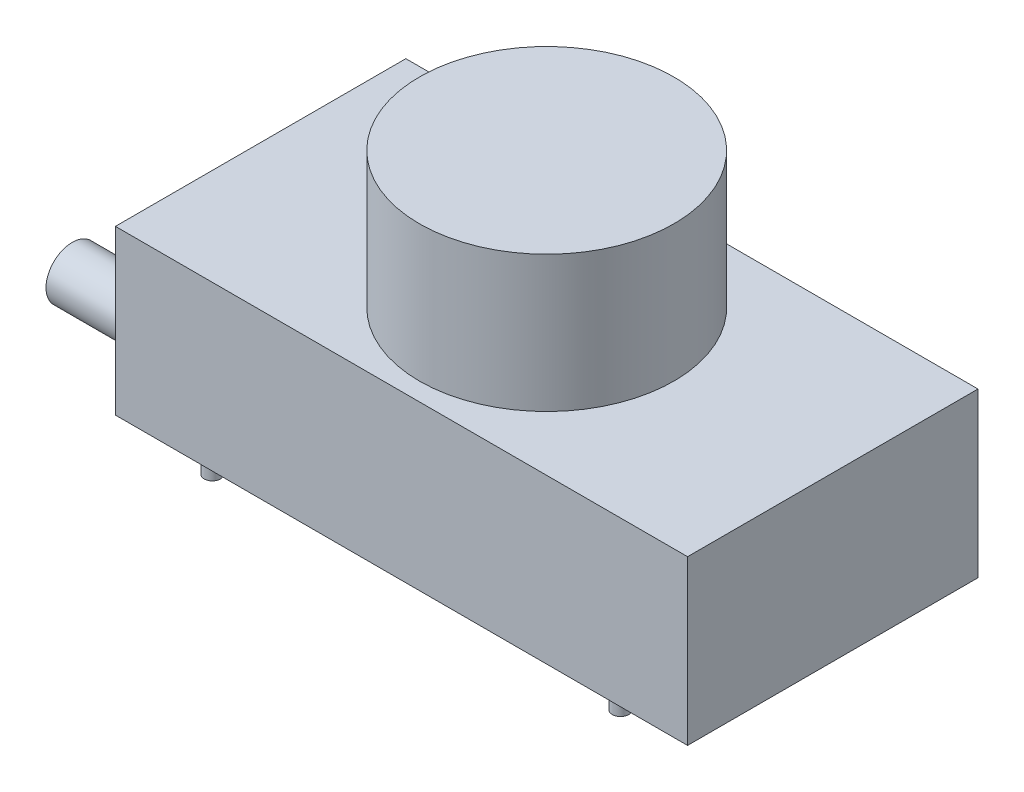
ISO-10303-21;
HEADER;
FILE_DESCRIPTION(('STEP AP214'),'2;1');
FILE_NAME('part.step','',(''),(''),'','','');
FILE_SCHEMA(('AUTOMOTIVE_DESIGN { 1 0 10303 214 1 1 1 1 }'));
ENDSEC;
DATA;
#1=APPLICATION_CONTEXT('core data for automotive mechanical design processes');
#2=APPLICATION_PROTOCOL_DEFINITION('international standard','automotive_design',2000,#1);
#3=PRODUCT_CONTEXT('',#1,'mechanical');
#4=PRODUCT('Part','Part','',(#3));
#5=PRODUCT_RELATED_PRODUCT_CATEGORY('part','',(#4));
#6=PRODUCT_DEFINITION_FORMATION('','',#4);
#7=PRODUCT_DEFINITION_CONTEXT('part definition',#1,'design');
#8=PRODUCT_DEFINITION('design','',#6,#7);
#9=PRODUCT_DEFINITION_SHAPE('','',#8);
#10=(LENGTH_UNIT() NAMED_UNIT(*) SI_UNIT(.MILLI.,.METRE.));
#11=(NAMED_UNIT(*) PLANE_ANGLE_UNIT() SI_UNIT($,.RADIAN.));
#12=(NAMED_UNIT(*) SI_UNIT($,.STERADIAN.) SOLID_ANGLE_UNIT());
#13=UNCERTAINTY_MEASURE_WITH_UNIT(LENGTH_MEASURE(1.E-05),#10,'distance_accuracy_value','');
#14=(GEOMETRIC_REPRESENTATION_CONTEXT(3) GLOBAL_UNCERTAINTY_ASSIGNED_CONTEXT((#13)) GLOBAL_UNIT_ASSIGNED_CONTEXT((#10,
#11,#12)) REPRESENTATION_CONTEXT('',''));
#15=CARTESIAN_POINT('',(0.,0.,0.));
#16=DIRECTION('',(0.,0.,1.));
#17=DIRECTION('',(1.,0.,0.));
#18=AXIS2_PLACEMENT_3D('',#15,#16,#17);
#19=CARTESIAN_POINT('',(-52.5,30.,26.65));
#20=DIRECTION('',(1.,0.,0.));
#21=DIRECTION('',(0.,0.,-1.));
#22=AXIS2_PLACEMENT_3D('',#19,#20,#21);
#23=PLANE('',#22);
#24=CARTESIAN_POINT('',(-52.5,6.60271093703635,14.5675092797255));
#25=DIRECTION('',(1.,0.,0.));
#26=DIRECTION('',(0.,0.,-1.));
#27=AXIS2_PLACEMENT_3D('',#24,#25,#26);
#28=CIRCLE('',#27,4.81872066748661);
#29=CARTESIAN_POINT('',(-52.5,6.60271093703635,9.74878861223889));
#30=VERTEX_POINT('',#29);
#31=EDGE_CURVE('E43',#30,#30,#28,.F.);
#32=ORIENTED_EDGE('',*,*,#31,.F.);
#33=EDGE_LOOP('',(#32));
#34=FACE_BOUND('',#33,.T.);
#35=DIRECTION('',(0.,0.,1.));
#36=VECTOR('',#35,1.);
#37=CARTESIAN_POINT('',(-52.5,0.,26.65));
#38=LINE('',#37,#36);
#39=CARTESIAN_POINT('',(-52.5,0.,-26.65));
#40=VERTEX_POINT('',#39);
#41=CARTESIAN_POINT('',(-52.5,0.,26.65));
#42=VERTEX_POINT('',#41);
#43=EDGE_CURVE('E158',#40,#42,#38,.T.);
#44=ORIENTED_EDGE('',*,*,#43,.T.);
#45=DIRECTION('',(0.,-1.,0.));
#46=VECTOR('',#45,1.);
#47=CARTESIAN_POINT('',(-52.5,30.,26.65));
#48=LINE('',#47,#46);
#49=CARTESIAN_POINT('',(-52.5,30.,26.65));
#50=VERTEX_POINT('',#49);
#51=EDGE_CURVE('E166',#50,#42,#48,.T.);
#52=ORIENTED_EDGE('',*,*,#51,.F.);
#53=DIRECTION('',(0.,0.,1.));
#54=VECTOR('',#53,1.);
#55=CARTESIAN_POINT('',(-52.5,30.,26.65));
#56=LINE('',#55,#54);
#57=CARTESIAN_POINT('',(-52.5,30.,-26.65));
#58=VERTEX_POINT('',#57);
#59=EDGE_CURVE('E149',#58,#50,#56,.T.);
#60=ORIENTED_EDGE('',*,*,#59,.F.);
#61=DIRECTION('',(0.,-1.,0.));
#62=VECTOR('',#61,1.);
#63=CARTESIAN_POINT('',(-52.5,30.,-26.65));
#64=LINE('',#63,#62);
#65=EDGE_CURVE('E170',#58,#40,#64,.T.);
#66=ORIENTED_EDGE('',*,*,#65,.T.);
#67=EDGE_LOOP('',(#44,#52,#60,#66));
#68=FACE_BOUND('',#67,.T.);
#69=DIRECTION('',(0.,1.,0.));
#70=VECTOR('',#69,1.);
#71=CARTESIAN_POINT('',(-52.5,1.57083362304267,-14.011997553169));
#72=LINE('',#71,#70);
#73=CARTESIAN_POINT('',(-52.5,1.57083362304267,-14.011997553169));
#74=VERTEX_POINT('',#73);
#75=CARTESIAN_POINT('',(-52.5,8.82388546653612,-14.011997553169));
#76=VERTEX_POINT('',#75);
#77=EDGE_CURVE('E128',#74,#76,#72,.T.);
#78=ORIENTED_EDGE('',*,*,#77,.F.);
#79=DIRECTION('',(0.,0.,1.));
#80=VECTOR('',#79,1.);
#81=CARTESIAN_POINT('',(-52.5,1.57083362304267,-21.6019036167339));
#82=LINE('',#81,#80);
#83=CARTESIAN_POINT('',(-52.5,1.57083362304267,-21.6019036167339));
#84=VERTEX_POINT('',#83);
#85=EDGE_CURVE('E125',#84,#74,#82,.T.);
#86=ORIENTED_EDGE('',*,*,#85,.F.);
#87=DIRECTION('',(0.,-1.,0.));
#88=VECTOR('',#87,1.);
#89=CARTESIAN_POINT('',(-52.5,1.57083362304267,-21.6019036167339));
#90=LINE('',#89,#88);
#91=CARTESIAN_POINT('',(-52.5,8.82388546653612,-21.6019036167339));
#92=VERTEX_POINT('',#91);
#93=EDGE_CURVE('E61',#92,#84,#90,.T.);
#94=ORIENTED_EDGE('',*,*,#93,.F.);
#95=DIRECTION('',(0.,0.,-1.));
#96=VECTOR('',#95,1.);
#97=CARTESIAN_POINT('',(-52.5,8.82388546653612,-21.6019036167339));
#98=LINE('',#97,#96);
#99=EDGE_CURVE('E56',#76,#92,#98,.T.);
#100=ORIENTED_EDGE('',*,*,#99,.F.);
#101=EDGE_LOOP('',(#78,#86,#94,#100));
#102=FACE_BOUND('',#101,.T.);
#103=ADVANCED_FACE('F39',(#34,#68,#102),#23,.F.);
#104=CARTESIAN_POINT('',(52.5,30.,26.65));
#105=DIRECTION('',(-1.,0.,0.));
#106=DIRECTION('',(0.,0.,1.));
#107=AXIS2_PLACEMENT_3D('',#104,#105,#106);
#108=PLANE('',#107);
#109=DIRECTION('',(0.,0.,-1.));
#110=VECTOR('',#109,1.);
#111=CARTESIAN_POINT('',(52.5,0.,26.65));
#112=LINE('',#111,#110);
#113=CARTESIAN_POINT('',(52.5,0.,26.65));
#114=VERTEX_POINT('',#113);
#115=CARTESIAN_POINT('',(52.5,0.,-26.65));
#116=VERTEX_POINT('',#115);
#117=EDGE_CURVE('E130',#114,#116,#112,.T.);
#118=ORIENTED_EDGE('',*,*,#117,.T.);
#119=DIRECTION('',(0.,-1.,0.));
#120=VECTOR('',#119,1.);
#121=CARTESIAN_POINT('',(52.5,30.,-26.65));
#122=LINE('',#121,#120);
#123=CARTESIAN_POINT('',(52.5,30.,-26.65));
#124=VERTEX_POINT('',#123);
#125=EDGE_CURVE('E173',#124,#116,#122,.T.);
#126=ORIENTED_EDGE('',*,*,#125,.F.);
#127=DIRECTION('',(0.,0.,-1.));
#128=VECTOR('',#127,1.);
#129=CARTESIAN_POINT('',(52.5,30.,26.65));
#130=LINE('',#129,#128);
#131=CARTESIAN_POINT('',(52.5,30.,26.65));
#132=VERTEX_POINT('',#131);
#133=EDGE_CURVE('E141',#132,#124,#130,.T.);
#134=ORIENTED_EDGE('',*,*,#133,.F.);
#135=DIRECTION('',(0.,-1.,0.));
#136=VECTOR('',#135,1.);
#137=CARTESIAN_POINT('',(52.5,30.,26.65));
#138=LINE('',#137,#136);
#139=EDGE_CURVE('E154',#132,#114,#138,.T.);
#140=ORIENTED_EDGE('',*,*,#139,.T.);
#141=EDGE_LOOP('',(#118,#126,#134,#140));
#142=FACE_BOUND('',#141,.T.);
#143=ADVANCED_FACE('F41',(#142),#108,.F.);
#144=CARTESIAN_POINT('',(-52.5,30.,-26.65));
#145=DIRECTION('',(0.,0.,1.));
#146=DIRECTION('',(1.,0.,0.));
#147=AXIS2_PLACEMENT_3D('',#144,#145,#146);
#148=PLANE('',#147);
#149=DIRECTION('',(-1.,0.,0.));
#150=VECTOR('',#149,1.);
#151=CARTESIAN_POINT('',(-52.5,0.,-26.65));
#152=LINE('',#151,#150);
#153=EDGE_CURVE('E135',#116,#40,#152,.T.);
#154=ORIENTED_EDGE('',*,*,#153,.T.);
#155=ORIENTED_EDGE('',*,*,#65,.F.);
#156=DIRECTION('',(-1.,0.,0.));
#157=VECTOR('',#156,1.);
#158=CARTESIAN_POINT('',(-52.5,30.,-26.65));
#159=LINE('',#158,#157);
#160=EDGE_CURVE('E145',#124,#58,#159,.T.);
#161=ORIENTED_EDGE('',*,*,#160,.F.);
#162=ORIENTED_EDGE('',*,*,#125,.T.);
#163=EDGE_LOOP('',(#154,#155,#161,#162));
#164=FACE_BOUND('',#163,.T.);
#165=ADVANCED_FACE('F283',(#164),#148,.F.);
#166=CARTESIAN_POINT('',(-52.5,30.,26.65));
#167=DIRECTION('',(0.,0.,-1.));
#168=DIRECTION('',(-1.,0.,0.));
#169=AXIS2_PLACEMENT_3D('',#166,#167,#168);
#170=PLANE('',#169);
#171=DIRECTION('',(1.,0.,0.));
#172=VECTOR('',#171,1.);
#173=CARTESIAN_POINT('',(-52.5,0.,26.65));
#174=LINE('',#173,#172);
#175=EDGE_CURVE('E146',#42,#114,#174,.T.);
#176=ORIENTED_EDGE('',*,*,#175,.T.);
#177=ORIENTED_EDGE('',*,*,#139,.F.);
#178=DIRECTION('',(1.,0.,0.));
#179=VECTOR('',#178,1.);
#180=CARTESIAN_POINT('',(-52.5,30.,26.65));
#181=LINE('',#180,#179);
#182=EDGE_CURVE('E152',#50,#132,#181,.T.);
#183=ORIENTED_EDGE('',*,*,#182,.F.);
#184=ORIENTED_EDGE('',*,*,#51,.T.);
#185=EDGE_LOOP('',(#176,#177,#183,#184));
#186=FACE_BOUND('',#185,.T.);
#187=ADVANCED_FACE('F279',(#186),#170,.F.);
#188=CARTESIAN_POINT('',(0.,30.,0.));
#189=DIRECTION('',(0.,-1.,0.));
#190=DIRECTION('',(0.,0.,-1.));
#191=AXIS2_PLACEMENT_3D('',#188,#189,#190);
#192=PLANE('',#191);
#193=CARTESIAN_POINT('',(0.,30.,0.));
#194=DIRECTION('',(0.,1.,0.));
#195=DIRECTION('',(0.,0.,1.));
#196=AXIS2_PLACEMENT_3D('',#193,#194,#195);
#197=CIRCLE('',#196,23.3494689800035);
#198=CARTESIAN_POINT('',(0.,30.,23.3494689800035));
#199=VERTEX_POINT('',#198);
#200=EDGE_CURVE('E11',#199,#199,#197,.T.);
#201=ORIENTED_EDGE('',*,*,#200,.F.);
#202=EDGE_LOOP('',(#201));
#203=FACE_BOUND('',#202,.T.);
#204=ORIENTED_EDGE('',*,*,#133,.T.);
#205=ORIENTED_EDGE('',*,*,#160,.T.);
#206=ORIENTED_EDGE('',*,*,#59,.T.);
#207=ORIENTED_EDGE('',*,*,#182,.T.);
#208=EDGE_LOOP('',(#204,#205,#206,#207));
#209=FACE_BOUND('',#208,.T.);
#210=ADVANCED_FACE('F264',(#203,#209),#192,.F.);
#211=CARTESIAN_POINT('',(0.,0.,0.));
#212=DIRECTION('',(0.,-1.,0.));
#213=DIRECTION('',(0.,0.,-1.));
#214=AXIS2_PLACEMENT_3D('',#211,#212,#213);
#215=PLANE('',#214);
#216=CARTESIAN_POINT('',(43.6,0.,-24.15));
#217=DIRECTION('',(0.,-1.,0.));
#218=DIRECTION('',(0.,0.,-1.));
#219=AXIS2_PLACEMENT_3D('',#216,#217,#218);
#220=CIRCLE('',#219,1.5);
#221=CARTESIAN_POINT('',(43.6,0.,-25.65));
#222=VERTEX_POINT('',#221);
#223=EDGE_CURVE('E244',#222,#222,#220,.T.);
#224=ORIENTED_EDGE('',*,*,#223,.F.);
#225=EDGE_LOOP('',(#224));
#226=FACE_BOUND('',#225,.T.);
#227=CARTESIAN_POINT('',(37.7,0.,24.15));
#228=DIRECTION('',(0.,-1.,0.));
#229=DIRECTION('',(0.,0.,-1.));
#230=AXIS2_PLACEMENT_3D('',#227,#228,#229);
#231=CIRCLE('',#230,1.5);
#232=CARTESIAN_POINT('',(37.7,0.,22.65));
#233=VERTEX_POINT('',#232);
#234=EDGE_CURVE('E236',#233,#233,#231,.T.);
#235=ORIENTED_EDGE('',*,*,#234,.F.);
#236=EDGE_LOOP('',(#235));
#237=FACE_BOUND('',#236,.T.);
#238=CARTESIAN_POINT('',(-38.5,0.,-24.15));
#239=DIRECTION('',(0.,-1.,0.));
#240=DIRECTION('',(0.,0.,-1.));
#241=AXIS2_PLACEMENT_3D('',#238,#239,#240);
#242=CIRCLE('',#241,1.5);
#243=CARTESIAN_POINT('',(-38.5,0.,-25.65));
#244=VERTEX_POINT('',#243);
#245=EDGE_CURVE('E228',#244,#244,#242,.T.);
#246=ORIENTED_EDGE('',*,*,#245,.F.);
#247=EDGE_LOOP('',(#246));
#248=FACE_BOUND('',#247,.T.);
#249=CARTESIAN_POINT('',(-37.2,0.,24.15));
#250=DIRECTION('',(0.,-1.,0.));
#251=DIRECTION('',(0.,0.,-1.));
#252=AXIS2_PLACEMENT_3D('',#249,#250,#251);
#253=CIRCLE('',#252,1.5);
#254=CARTESIAN_POINT('',(-37.2,0.,22.65));
#255=VERTEX_POINT('',#254);
#256=EDGE_CURVE('E220',#255,#255,#253,.T.);
#257=ORIENTED_EDGE('',*,*,#256,.F.);
#258=EDGE_LOOP('',(#257));
#259=FACE_BOUND('',#258,.T.);
#260=ORIENTED_EDGE('',*,*,#117,.F.);
#261=ORIENTED_EDGE('',*,*,#175,.F.);
#262=ORIENTED_EDGE('',*,*,#43,.F.);
#263=ORIENTED_EDGE('',*,*,#153,.F.);
#264=EDGE_LOOP('',(#260,#261,#262,#263));
#265=FACE_BOUND('',#264,.T.);
#266=ADVANCED_FACE('F261',(#226,#237,#248,#259,#265),#215,.T.);
#267=CARTESIAN_POINT('',(-72.5,1.57083362304267,-14.011997553169));
#268=DIRECTION('',(0.,0.,-1.));
#269=DIRECTION('',(-1.,0.,0.));
#270=AXIS2_PLACEMENT_3D('',#267,#268,#269);
#271=PLANE('',#270);
#272=ORIENTED_EDGE('',*,*,#77,.T.);
#273=DIRECTION('',(1.,0.,0.));
#274=VECTOR('',#273,1.);
#275=CARTESIAN_POINT('',(-72.5,8.82388546653612,-14.011997553169));
#276=LINE('',#275,#274);
#277=CARTESIAN_POINT('',(-72.5,8.82388546653612,-14.011997553169));
#278=VERTEX_POINT('',#277);
#279=EDGE_CURVE('E107',#278,#76,#276,.T.);
#280=ORIENTED_EDGE('',*,*,#279,.F.);
#281=DIRECTION('',(0.,1.,0.));
#282=VECTOR('',#281,1.);
#283=CARTESIAN_POINT('',(-72.5,1.57083362304267,-14.011997553169));
#284=LINE('',#283,#282);
#285=CARTESIAN_POINT('',(-72.5,1.57083362304267,-14.011997553169));
#286=VERTEX_POINT('',#285);
#287=EDGE_CURVE('E115',#286,#278,#284,.T.);
#288=ORIENTED_EDGE('',*,*,#287,.F.);
#289=DIRECTION('',(1.,0.,0.));
#290=VECTOR('',#289,1.);
#291=CARTESIAN_POINT('',(-72.5,1.57083362304267,-14.011997553169));
#292=LINE('',#291,#290);
#293=EDGE_CURVE('E196',#286,#74,#292,.T.);
#294=ORIENTED_EDGE('',*,*,#293,.T.);
#295=EDGE_LOOP('',(#272,#280,#288,#294));
#296=FACE_BOUND('',#295,.T.);
#297=ADVANCED_FACE('F127',(#296),#271,.F.);
#298=CARTESIAN_POINT('',(-72.5,8.82388546653612,-21.6019036167339));
#299=DIRECTION('',(0.,-1.,0.));
#300=DIRECTION('',(0.,0.,-1.));
#301=AXIS2_PLACEMENT_3D('',#298,#299,#300);
#302=PLANE('',#301);
#303=ORIENTED_EDGE('',*,*,#99,.T.);
#304=DIRECTION('',(1.,0.,0.));
#305=VECTOR('',#304,1.);
#306=CARTESIAN_POINT('',(-72.5,8.82388546653612,-21.6019036167339));
#307=LINE('',#306,#305);
#308=CARTESIAN_POINT('',(-72.5,8.82388546653612,-21.6019036167339));
#309=VERTEX_POINT('',#308);
#310=EDGE_CURVE('E110',#309,#92,#307,.T.);
#311=ORIENTED_EDGE('',*,*,#310,.F.);
#312=DIRECTION('',(0.,0.,-1.));
#313=VECTOR('',#312,1.);
#314=CARTESIAN_POINT('',(-72.5,8.82388546653612,-21.6019036167339));
#315=LINE('',#314,#313);
#316=EDGE_CURVE('E103',#278,#309,#315,.T.);
#317=ORIENTED_EDGE('',*,*,#316,.F.);
#318=ORIENTED_EDGE('',*,*,#279,.T.);
#319=EDGE_LOOP('',(#303,#311,#317,#318));
#320=FACE_BOUND('',#319,.T.);
#321=ADVANCED_FACE('F105',(#320),#302,.F.);
#322=CARTESIAN_POINT('',(-72.5,1.57083362304267,-21.6019036167339));
#323=DIRECTION('',(0.,0.,1.));
#324=DIRECTION('',(1.,0.,0.));
#325=AXIS2_PLACEMENT_3D('',#322,#323,#324);
#326=PLANE('',#325);
#327=ORIENTED_EDGE('',*,*,#93,.T.);
#328=DIRECTION('',(1.,0.,0.));
#329=VECTOR('',#328,1.);
#330=CARTESIAN_POINT('',(-72.5,1.57083362304267,-21.6019036167339));
#331=LINE('',#330,#329);
#332=CARTESIAN_POINT('',(-72.5,1.57083362304267,-21.6019036167339));
#333=VERTEX_POINT('',#332);
#334=EDGE_CURVE('E137',#333,#84,#331,.T.);
#335=ORIENTED_EDGE('',*,*,#334,.F.);
#336=DIRECTION('',(0.,-1.,0.));
#337=VECTOR('',#336,1.);
#338=CARTESIAN_POINT('',(-72.5,1.57083362304267,-21.6019036167339));
#339=LINE('',#338,#337);
#340=EDGE_CURVE('E114',#309,#333,#339,.T.);
#341=ORIENTED_EDGE('',*,*,#340,.F.);
#342=ORIENTED_EDGE('',*,*,#310,.T.);
#343=EDGE_LOOP('',(#327,#335,#341,#342));
#344=FACE_BOUND('',#343,.T.);
#345=ADVANCED_FACE('F298',(#344),#326,.F.);
#346=CARTESIAN_POINT('',(-72.5,1.57083362304267,-21.6019036167339));
#347=DIRECTION('',(0.,1.,0.));
#348=DIRECTION('',(0.,0.,1.));
#349=AXIS2_PLACEMENT_3D('',#346,#347,#348);
#350=PLANE('',#349);
#351=ORIENTED_EDGE('',*,*,#85,.T.);
#352=ORIENTED_EDGE('',*,*,#293,.F.);
#353=DIRECTION('',(0.,0.,1.));
#354=VECTOR('',#353,1.);
#355=CARTESIAN_POINT('',(-72.5,1.57083362304267,-21.6019036167339));
#356=LINE('',#355,#354);
#357=EDGE_CURVE('E120',#333,#286,#356,.T.);
#358=ORIENTED_EDGE('',*,*,#357,.F.);
#359=ORIENTED_EDGE('',*,*,#334,.T.);
#360=EDGE_LOOP('',(#351,#352,#358,#359));
#361=FACE_BOUND('',#360,.T.);
#362=ADVANCED_FACE('F195',(#361),#350,.F.);
#363=CARTESIAN_POINT('',(-72.5,0.,0.));
#364=DIRECTION('',(1.,0.,0.));
#365=DIRECTION('',(0.,0.,-1.));
#366=AXIS2_PLACEMENT_3D('',#363,#364,#365);
#367=PLANE('',#366);
#368=ORIENTED_EDGE('',*,*,#287,.T.);
#369=ORIENTED_EDGE('',*,*,#316,.T.);
#370=ORIENTED_EDGE('',*,*,#340,.T.);
#371=ORIENTED_EDGE('',*,*,#357,.T.);
#372=EDGE_LOOP('',(#368,#369,#370,#371));
#373=FACE_BOUND('',#372,.T.);
#374=ADVANCED_FACE('F118',(#373),#367,.F.);
#375=CARTESIAN_POINT('',(-72.5,6.60271093703635,14.5675092797255));
#376=DIRECTION('',(1.,0.,0.));
#377=DIRECTION('',(0.,0.,-1.));
#378=AXIS2_PLACEMENT_3D('',#375,#376,#377);
#379=CYLINDRICAL_SURFACE('',#378,4.81872066748661);
#380=CARTESIAN_POINT('',(-72.5,6.60271093703635,14.5675092797255));
#381=DIRECTION('',(-1.,0.,0.));
#382=DIRECTION('',(0.,0.,1.));
#383=AXIS2_PLACEMENT_3D('',#380,#381,#382);
#384=CIRCLE('',#383,4.81872066748661);
#385=CARTESIAN_POINT('',(-72.5,6.60271093703635,19.3862299472121));
#386=VERTEX_POINT('',#385);
#387=EDGE_CURVE('E191',#386,#386,#384,.T.);
#388=ORIENTED_EDGE('',*,*,#387,.F.);
#389=EDGE_LOOP('',(#388));
#390=FACE_BOUND('',#389,.T.);
#391=ORIENTED_EDGE('',*,*,#31,.T.);
#392=EDGE_LOOP('',(#391));
#393=FACE_BOUND('',#392,.T.);
#394=ADVANCED_FACE('F182',(#390,#393),#379,.T.);
#395=CARTESIAN_POINT('',(-72.5,6.60271093703635,14.5675092797255));
#396=DIRECTION('',(-1.,0.,0.));
#397=DIRECTION('',(0.,0.,1.));
#398=AXIS2_PLACEMENT_3D('',#395,#396,#397);
#399=PLANE('',#398);
#400=ORIENTED_EDGE('',*,*,#387,.T.);
#401=EDGE_LOOP('',(#400));
#402=FACE_BOUND('',#401,.T.);
#403=ADVANCED_FACE('F308',(#402),#399,.T.);
#404=CARTESIAN_POINT('',(0.,55.,0.));
#405=DIRECTION('',(0.,-1.,0.));
#406=DIRECTION('',(0.,0.,-1.));
#407=AXIS2_PLACEMENT_3D('',#404,#405,#406);
#408=CYLINDRICAL_SURFACE('',#407,23.3494689800035);
#409=CARTESIAN_POINT('',(0.,55.,0.));
#410=DIRECTION('',(0.,1.,0.));
#411=DIRECTION('',(0.,0.,1.));
#412=AXIS2_PLACEMENT_3D('',#409,#410,#411);
#413=CIRCLE('',#412,23.3494689800035);
#414=CARTESIAN_POINT('',(0.,55.,23.3494689800035));
#415=VERTEX_POINT('',#414);
#416=EDGE_CURVE('E214',#415,#415,#413,.T.);
#417=ORIENTED_EDGE('',*,*,#416,.F.);
#418=EDGE_LOOP('',(#417));
#419=FACE_BOUND('',#418,.T.);
#420=ORIENTED_EDGE('',*,*,#200,.T.);
#421=EDGE_LOOP('',(#420));
#422=FACE_BOUND('',#421,.T.);
#423=ADVANCED_FACE('F312',(#419,#422),#408,.T.);
#424=CARTESIAN_POINT('',(0.,55.,0.));
#425=DIRECTION('',(0.,1.,0.));
#426=DIRECTION('',(0.,0.,1.));
#427=AXIS2_PLACEMENT_3D('',#424,#425,#426);
#428=PLANE('',#427);
#429=ORIENTED_EDGE('',*,*,#416,.T.);
#430=EDGE_LOOP('',(#429));
#431=FACE_BOUND('',#430,.T.);
#432=ADVANCED_FACE('F316',(#431),#428,.T.);
#433=CARTESIAN_POINT('',(-37.2,-3.,24.15));
#434=DIRECTION('',(0.,1.,0.));
#435=DIRECTION('',(0.,0.,1.));
#436=AXIS2_PLACEMENT_3D('',#433,#434,#435);
#437=CYLINDRICAL_SURFACE('',#436,1.5);
#438=CARTESIAN_POINT('',(-37.2,-3.,24.15));
#439=DIRECTION('',(0.,-1.,0.));
#440=DIRECTION('',(0.,0.,-1.));
#441=AXIS2_PLACEMENT_3D('',#438,#439,#440);
#442=CIRCLE('',#441,1.5);
#443=CARTESIAN_POINT('',(-37.2,-3.,22.65));
#444=VERTEX_POINT('',#443);
#445=EDGE_CURVE('E219',#444,#444,#442,.T.);
#446=ORIENTED_EDGE('',*,*,#445,.F.);
#447=EDGE_LOOP('',(#446));
#448=FACE_BOUND('',#447,.T.);
#449=ORIENTED_EDGE('',*,*,#256,.T.);
#450=EDGE_LOOP('',(#449));
#451=FACE_BOUND('',#450,.T.);
#452=ADVANCED_FACE('F320',(#448,#451),#437,.T.);
#453=CARTESIAN_POINT('',(-37.2,-3.,24.15));
#454=DIRECTION('',(0.,-1.,0.));
#455=DIRECTION('',(0.,0.,-1.));
#456=AXIS2_PLACEMENT_3D('',#453,#454,#455);
#457=PLANE('',#456);
#458=ORIENTED_EDGE('',*,*,#445,.T.);
#459=EDGE_LOOP('',(#458));
#460=FACE_BOUND('',#459,.T.);
#461=ADVANCED_FACE('F324',(#460),#457,.T.);
#462=CARTESIAN_POINT('',(-38.5,-3.,-24.15));
#463=DIRECTION('',(0.,1.,0.));
#464=DIRECTION('',(0.,0.,1.));
#465=AXIS2_PLACEMENT_3D('',#462,#463,#464);
#466=CYLINDRICAL_SURFACE('',#465,1.5);
#467=CARTESIAN_POINT('',(-38.5,-3.,-24.15));
#468=DIRECTION('',(0.,-1.,0.));
#469=DIRECTION('',(0.,0.,-1.));
#470=AXIS2_PLACEMENT_3D('',#467,#468,#469);
#471=CIRCLE('',#470,1.5);
#472=CARTESIAN_POINT('',(-38.5,-3.,-25.65));
#473=VERTEX_POINT('',#472);
#474=EDGE_CURVE('E224',#473,#473,#471,.T.);
#475=ORIENTED_EDGE('',*,*,#474,.F.);
#476=EDGE_LOOP('',(#475));
#477=FACE_BOUND('',#476,.T.);
#478=ORIENTED_EDGE('',*,*,#245,.T.);
#479=EDGE_LOOP('',(#478));
#480=FACE_BOUND('',#479,.T.);
#481=ADVANCED_FACE('F328',(#477,#480),#466,.T.);
#482=CARTESIAN_POINT('',(-38.5,-3.,-24.15));
#483=DIRECTION('',(0.,-1.,0.));
#484=DIRECTION('',(0.,0.,-1.));
#485=AXIS2_PLACEMENT_3D('',#482,#483,#484);
#486=PLANE('',#485);
#487=ORIENTED_EDGE('',*,*,#474,.T.);
#488=EDGE_LOOP('',(#487));
#489=FACE_BOUND('',#488,.T.);
#490=ADVANCED_FACE('F332',(#489),#486,.T.);
#491=CARTESIAN_POINT('',(37.7,-3.,24.15));
#492=DIRECTION('',(0.,1.,0.));
#493=DIRECTION('',(0.,0.,1.));
#494=AXIS2_PLACEMENT_3D('',#491,#492,#493);
#495=CYLINDRICAL_SURFACE('',#494,1.5);
#496=CARTESIAN_POINT('',(37.7,-3.,24.15));
#497=DIRECTION('',(0.,-1.,0.));
#498=DIRECTION('',(0.,0.,-1.));
#499=AXIS2_PLACEMENT_3D('',#496,#497,#498);
#500=CIRCLE('',#499,1.5);
#501=CARTESIAN_POINT('',(37.7,-3.,22.65));
#502=VERTEX_POINT('',#501);
#503=EDGE_CURVE('E232',#502,#502,#500,.T.);
#504=ORIENTED_EDGE('',*,*,#503,.F.);
#505=EDGE_LOOP('',(#504));
#506=FACE_BOUND('',#505,.T.);
#507=ORIENTED_EDGE('',*,*,#234,.T.);
#508=EDGE_LOOP('',(#507));
#509=FACE_BOUND('',#508,.T.);
#510=ADVANCED_FACE('F336',(#506,#509),#495,.T.);
#511=CARTESIAN_POINT('',(37.7,-3.,24.15));
#512=DIRECTION('',(0.,-1.,0.));
#513=DIRECTION('',(0.,0.,-1.));
#514=AXIS2_PLACEMENT_3D('',#511,#512,#513);
#515=PLANE('',#514);
#516=ORIENTED_EDGE('',*,*,#503,.T.);
#517=EDGE_LOOP('',(#516));
#518=FACE_BOUND('',#517,.T.);
#519=ADVANCED_FACE('F257',(#518),#515,.T.);
#520=CARTESIAN_POINT('',(43.6,-3.,-24.15));
#521=DIRECTION('',(0.,1.,0.));
#522=DIRECTION('',(0.,0.,1.));
#523=AXIS2_PLACEMENT_3D('',#520,#521,#522);
#524=CYLINDRICAL_SURFACE('',#523,1.5);
#525=CARTESIAN_POINT('',(43.6,-3.,-24.15));
#526=DIRECTION('',(0.,-1.,0.));
#527=DIRECTION('',(0.,0.,-1.));
#528=AXIS2_PLACEMENT_3D('',#525,#526,#527);
#529=CIRCLE('',#528,1.5);
#530=CARTESIAN_POINT('',(43.6,-3.,-25.65));
#531=VERTEX_POINT('',#530);
#532=EDGE_CURVE('E240',#531,#531,#529,.T.);
#533=ORIENTED_EDGE('',*,*,#532,.F.);
#534=EDGE_LOOP('',(#533));
#535=FACE_BOUND('',#534,.T.);
#536=ORIENTED_EDGE('',*,*,#223,.T.);
#537=EDGE_LOOP('',(#536));
#538=FACE_BOUND('',#537,.T.);
#539=ADVANCED_FACE('F254',(#535,#538),#524,.T.);
#540=CARTESIAN_POINT('',(43.6,-3.,-24.15));
#541=DIRECTION('',(0.,-1.,0.));
#542=DIRECTION('',(0.,0.,-1.));
#543=AXIS2_PLACEMENT_3D('',#540,#541,#542);
#544=PLANE('',#543);
#545=ORIENTED_EDGE('',*,*,#532,.T.);
#546=EDGE_LOOP('',(#545));
#547=FACE_BOUND('',#546,.T.);
#548=ADVANCED_FACE('F252',(#547),#544,.T.);
#549=CLOSED_SHELL('',(#103,#143,#165,#187,#210,#266,#297,#321,#345,#362,#374,#394,#403,#423,
#432,#452,#461,#481,#490,#510,#519,#539,#548));
#550=MANIFOLD_SOLID_BREP('B2',#549);
#551=ADVANCED_BREP_SHAPE_REPRESENTATION('',(#18,#550),#14);
#552=SHAPE_DEFINITION_REPRESENTATION(#9,#551);
ENDSEC;
END-ISO-10303-21;
